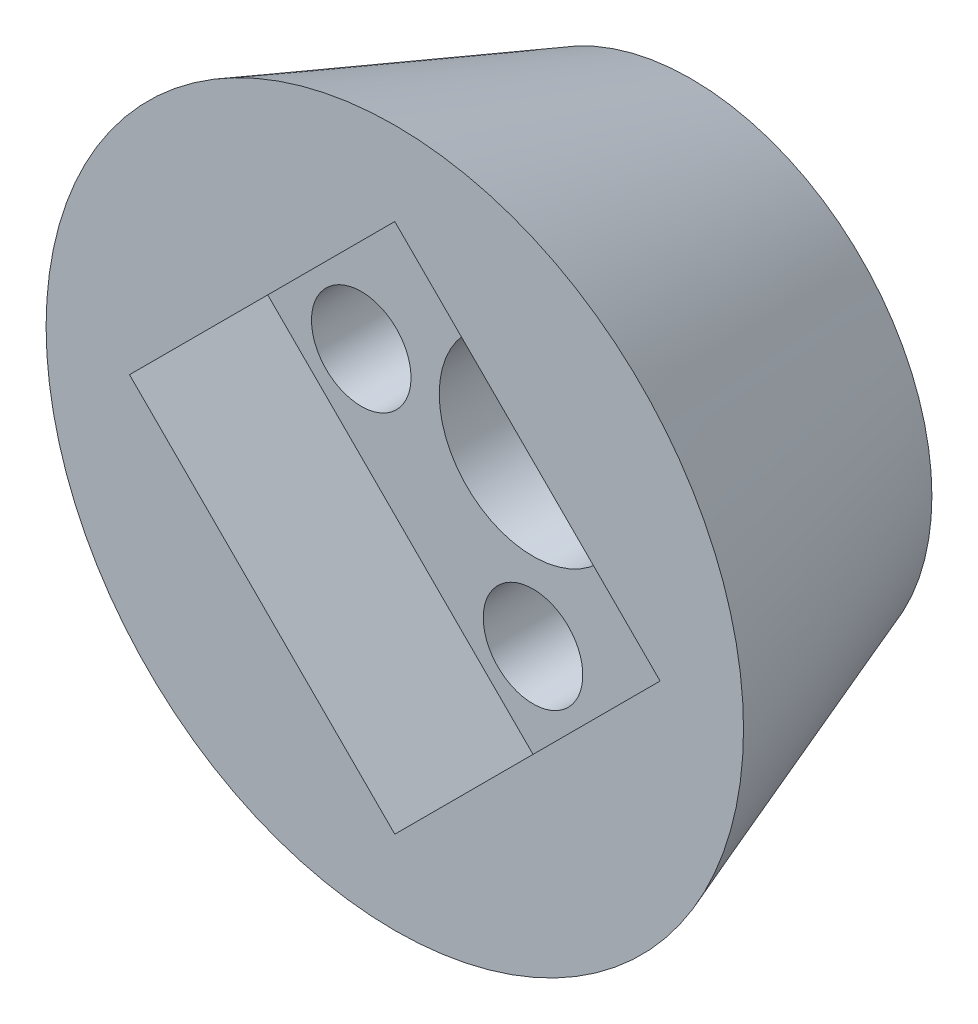
ISO-10303-21;
HEADER;
FILE_DESCRIPTION(('STEP AP214'),'2;1');
FILE_NAME('part.step','',(''),(''),'','','');
FILE_SCHEMA(('AUTOMOTIVE_DESIGN { 1 0 10303 214 1 1 1 1 }'));
ENDSEC;
DATA;
#1=APPLICATION_CONTEXT('core data for automotive mechanical design processes');
#2=APPLICATION_PROTOCOL_DEFINITION('international standard','automotive_design',2000,#1);
#3=PRODUCT_CONTEXT('',#1,'mechanical');
#4=PRODUCT('Part','Part','',(#3));
#5=PRODUCT_RELATED_PRODUCT_CATEGORY('part','',(#4));
#6=PRODUCT_DEFINITION_FORMATION('','',#4);
#7=PRODUCT_DEFINITION_CONTEXT('part definition',#1,'design');
#8=PRODUCT_DEFINITION('design','',#6,#7);
#9=PRODUCT_DEFINITION_SHAPE('','',#8);
#10=(LENGTH_UNIT() NAMED_UNIT(*) SI_UNIT(.MILLI.,.METRE.));
#11=(NAMED_UNIT(*) PLANE_ANGLE_UNIT() SI_UNIT($,.RADIAN.));
#12=(NAMED_UNIT(*) SI_UNIT($,.STERADIAN.) SOLID_ANGLE_UNIT());
#13=UNCERTAINTY_MEASURE_WITH_UNIT(LENGTH_MEASURE(1.E-05),#10,'distance_accuracy_value','');
#14=(GEOMETRIC_REPRESENTATION_CONTEXT(3) GLOBAL_UNCERTAINTY_ASSIGNED_CONTEXT((#13)) GLOBAL_UNIT_ASSIGNED_CONTEXT((#10,
#11,#12)) REPRESENTATION_CONTEXT('',''));
#15=CARTESIAN_POINT('',(0.,0.,0.));
#16=DIRECTION('',(0.,0.,1.));
#17=DIRECTION('',(1.,0.,0.));
#18=AXIS2_PLACEMENT_3D('',#15,#16,#17);
#19=CARTESIAN_POINT('',(0.,0.,0.));
#20=DIRECTION('',(0.,0.,1.));
#21=DIRECTION('',(1.,0.,0.));
#22=AXIS2_PLACEMENT_3D('',#19,#20,#21);
#23=CONICAL_SURFACE('',#22,12.2,0.349065850398867);
#24=CARTESIAN_POINT('',(0.,0.,15.));
#25=DIRECTION('',(0.,0.,1.));
#26=DIRECTION('',(1.,0.,0.));
#27=AXIS2_PLACEMENT_3D('',#24,#25,#26);
#28=CIRCLE('',#27,17.659553513993);
#29=CARTESIAN_POINT('',(17.659553513993,0.,15.));
#30=VERTEX_POINT('',#29);
#31=EDGE_CURVE('E11',#30,#30,#28,.T.);
#32=ORIENTED_EDGE('',*,*,#31,.F.);
#33=EDGE_LOOP('',(#32));
#34=FACE_BOUND('',#33,.T.);
#35=CARTESIAN_POINT('',(0.,0.,0.));
#36=DIRECTION('',(0.,0.,1.));
#37=DIRECTION('',(1.,0.,0.));
#38=AXIS2_PLACEMENT_3D('',#35,#36,#37);
#39=CIRCLE('',#38,12.2);
#40=CARTESIAN_POINT('',(12.2,0.,0.));
#41=VERTEX_POINT('',#40);
#42=EDGE_CURVE('E40',#41,#41,#39,.T.);
#43=ORIENTED_EDGE('',*,*,#42,.T.);
#44=EDGE_LOOP('',(#43));
#45=FACE_BOUND('',#44,.T.);
#46=ADVANCED_FACE('F32',(#34,#45),#23,.T.);
#47=CARTESIAN_POINT('',(0.,0.,15.));
#48=DIRECTION('',(0.,0.,1.));
#49=DIRECTION('',(1.,0.,0.));
#50=AXIS2_PLACEMENT_3D('',#47,#48,#49);
#51=PLANE('',#50);
#52=DIRECTION('',(-0.707106781186547,-0.707106781186548,0.));
#53=VECTOR('',#52,1.);
#54=CARTESIAN_POINT('',(-13.4350288425444,0.,15.));
#55=LINE('',#54,#53);
#56=CARTESIAN_POINT('',(0.,13.4350288425444,15.));
#57=VERTEX_POINT('',#56);
#58=CARTESIAN_POINT('',(-13.4350288425444,0.,15.));
#59=VERTEX_POINT('',#58);
#60=EDGE_CURVE('E47',#57,#59,#55,.T.);
#61=ORIENTED_EDGE('',*,*,#60,.F.);
#62=DIRECTION('',(-0.707106781186548,0.707106781186548,0.));
#63=VECTOR('',#62,1.);
#64=CARTESIAN_POINT('',(0.,13.4350288425444,15.));
#65=LINE('',#64,#63);
#66=CARTESIAN_POINT('',(13.4350288425444,0.,15.));
#67=VERTEX_POINT('',#66);
#68=EDGE_CURVE('E99',#67,#57,#65,.T.);
#69=ORIENTED_EDGE('',*,*,#68,.F.);
#70=DIRECTION('',(0.707106781186548,0.707106781186548,0.));
#71=VECTOR('',#70,1.);
#72=CARTESIAN_POINT('',(13.4350288425444,0.,15.));
#73=LINE('',#72,#71);
#74=CARTESIAN_POINT('',(0.,-13.4350288425444,15.));
#75=VERTEX_POINT('',#74);
#76=EDGE_CURVE('E105',#75,#67,#73,.T.);
#77=ORIENTED_EDGE('',*,*,#76,.F.);
#78=DIRECTION('',(0.707106781186548,-0.707106781186548,0.));
#79=VECTOR('',#78,1.);
#80=CARTESIAN_POINT('',(0.,-13.4350288425444,15.));
#81=LINE('',#80,#79);
#82=EDGE_CURVE('E82',#59,#75,#81,.T.);
#83=ORIENTED_EDGE('',*,*,#82,.F.);
#84=EDGE_LOOP('',(#61,#69,#77,#83));
#85=FACE_BOUND('',#84,.T.);
#86=ORIENTED_EDGE('',*,*,#31,.T.);
#87=EDGE_LOOP('',(#86));
#88=FACE_BOUND('',#87,.T.);
#89=ADVANCED_FACE('F145',(#85,#88),#51,.T.);
#90=CARTESIAN_POINT('',(0.,0.,0.));
#91=DIRECTION('',(0.,0.,1.));
#92=DIRECTION('',(1.,0.,0.));
#93=AXIS2_PLACEMENT_3D('',#90,#91,#92);
#94=PLANE('',#93);
#95=CARTESIAN_POINT('',(8.7,0.,0.));
#96=DIRECTION('',(0.,0.,-1.));
#97=DIRECTION('',(-1.,0.,0.));
#98=AXIS2_PLACEMENT_3D('',#95,#96,#97);
#99=CIRCLE('',#98,2.52);
#100=CARTESIAN_POINT('',(6.18,0.,0.));
#101=VERTEX_POINT('',#100);
#102=EDGE_CURVE('E123',#101,#101,#99,.T.);
#103=ORIENTED_EDGE('',*,*,#102,.F.);
#104=EDGE_LOOP('',(#103));
#105=FACE_BOUND('',#104,.T.);
#106=CARTESIAN_POINT('',(0.,-8.7,0.));
#107=DIRECTION('',(0.,0.,-1.));
#108=DIRECTION('',(-1.,0.,0.));
#109=AXIS2_PLACEMENT_3D('',#106,#107,#108);
#110=CIRCLE('',#109,2.52);
#111=CARTESIAN_POINT('',(-2.52,-8.7,0.));
#112=VERTEX_POINT('',#111);
#113=EDGE_CURVE('E126',#112,#112,#110,.T.);
#114=ORIENTED_EDGE('',*,*,#113,.F.);
#115=EDGE_LOOP('',(#114));
#116=FACE_BOUND('',#115,.T.);
#117=CARTESIAN_POINT('',(-8.7,0.,0.));
#118=DIRECTION('',(0.,0.,-1.));
#119=DIRECTION('',(-1.,0.,0.));
#120=AXIS2_PLACEMENT_3D('',#117,#118,#119);
#121=CIRCLE('',#120,2.52);
#122=CARTESIAN_POINT('',(-11.22,0.,0.));
#123=VERTEX_POINT('',#122);
#124=EDGE_CURVE('E129',#123,#123,#121,.T.);
#125=ORIENTED_EDGE('',*,*,#124,.F.);
#126=EDGE_LOOP('',(#125));
#127=FACE_BOUND('',#126,.T.);
#128=CARTESIAN_POINT('',(0.,8.7,0.));
#129=DIRECTION('',(0.,0.,-1.));
#130=DIRECTION('',(-1.,0.,0.));
#131=AXIS2_PLACEMENT_3D('',#128,#129,#130);
#132=CIRCLE('',#131,2.52);
#133=CARTESIAN_POINT('',(-2.52,8.7,0.));
#134=VERTEX_POINT('',#133);
#135=EDGE_CURVE('E132',#134,#134,#132,.T.);
#136=ORIENTED_EDGE('',*,*,#135,.F.);
#137=EDGE_LOOP('',(#136));
#138=FACE_BOUND('',#137,.T.);
#139=CARTESIAN_POINT('',(0.,0.,0.));
#140=DIRECTION('',(0.,0.,-1.));
#141=DIRECTION('',(-1.,0.,0.));
#142=AXIS2_PLACEMENT_3D('',#139,#140,#141);
#143=CIRCLE('',#142,4.75);
#144=CARTESIAN_POINT('',(-4.75,0.,0.));
#145=VERTEX_POINT('',#144);
#146=EDGE_CURVE('E135',#145,#145,#143,.T.);
#147=ORIENTED_EDGE('',*,*,#146,.F.);
#148=EDGE_LOOP('',(#147));
#149=FACE_BOUND('',#148,.T.);
#150=ORIENTED_EDGE('',*,*,#42,.F.);
#151=EDGE_LOOP('',(#150));
#152=FACE_BOUND('',#151,.T.);
#153=ADVANCED_FACE('F142',(#105,#116,#127,#138,#149,#152),#94,.F.);
#154=CARTESIAN_POINT('',(0.,0.,15.));
#155=DIRECTION('',(0.,0.,-1.));
#156=DIRECTION('',(-1.,0.,0.));
#157=AXIS2_PLACEMENT_3D('',#154,#155,#156);
#158=CYLINDRICAL_SURFACE('',#157,4.75);
#159=CARTESIAN_POINT('',(0.,0.,8.));
#160=DIRECTION('',(0.,0.,-1.));
#161=DIRECTION('',(-1.,0.,0.));
#162=AXIS2_PLACEMENT_3D('',#159,#160,#161);
#163=CIRCLE('',#162,4.75);
#164=CARTESIAN_POINT('',(-4.75,0.,8.));
#165=VERTEX_POINT('',#164);
#166=EDGE_CURVE('E120',#165,#165,#163,.F.);
#167=ORIENTED_EDGE('',*,*,#166,.T.);
#168=EDGE_LOOP('',(#167));
#169=FACE_BOUND('',#168,.T.);
#170=ORIENTED_EDGE('',*,*,#146,.T.);
#171=EDGE_LOOP('',(#170));
#172=FACE_BOUND('',#171,.T.);
#173=ADVANCED_FACE('F144',(#169,#172),#158,.F.);
#174=CARTESIAN_POINT('',(0.,8.7,15.));
#175=DIRECTION('',(0.,0.,-1.));
#176=DIRECTION('',(-1.,0.,0.));
#177=AXIS2_PLACEMENT_3D('',#174,#175,#176);
#178=CYLINDRICAL_SURFACE('',#177,2.52);
#179=CARTESIAN_POINT('',(0.,8.7,8.));
#180=DIRECTION('',(0.,0.,-1.));
#181=DIRECTION('',(-1.,0.,0.));
#182=AXIS2_PLACEMENT_3D('',#179,#180,#181);
#183=CIRCLE('',#182,2.52);
#184=CARTESIAN_POINT('',(-2.52,8.7,8.));
#185=VERTEX_POINT('',#184);
#186=EDGE_CURVE('E117',#185,#185,#183,.F.);
#187=ORIENTED_EDGE('',*,*,#186,.T.);
#188=EDGE_LOOP('',(#187));
#189=FACE_BOUND('',#188,.T.);
#190=ORIENTED_EDGE('',*,*,#135,.T.);
#191=EDGE_LOOP('',(#190));
#192=FACE_BOUND('',#191,.T.);
#193=ADVANCED_FACE('F151',(#189,#192),#178,.F.);
#194=CARTESIAN_POINT('',(-8.7,0.,15.));
#195=DIRECTION('',(0.,0.,-1.));
#196=DIRECTION('',(-1.,0.,0.));
#197=AXIS2_PLACEMENT_3D('',#194,#195,#196);
#198=CYLINDRICAL_SURFACE('',#197,2.52);
#199=CARTESIAN_POINT('',(-8.7,0.,8.));
#200=DIRECTION('',(0.,0.,-1.));
#201=DIRECTION('',(-1.,0.,0.));
#202=AXIS2_PLACEMENT_3D('',#199,#200,#201);
#203=CIRCLE('',#202,2.52);
#204=CARTESIAN_POINT('',(-11.22,0.,8.));
#205=VERTEX_POINT('',#204);
#206=EDGE_CURVE('E114',#205,#205,#203,.F.);
#207=ORIENTED_EDGE('',*,*,#206,.T.);
#208=EDGE_LOOP('',(#207));
#209=FACE_BOUND('',#208,.T.);
#210=ORIENTED_EDGE('',*,*,#124,.T.);
#211=EDGE_LOOP('',(#210));
#212=FACE_BOUND('',#211,.T.);
#213=ADVANCED_FACE('F185',(#209,#212),#198,.F.);
#214=CARTESIAN_POINT('',(0.,-8.7,15.));
#215=DIRECTION('',(0.,0.,-1.));
#216=DIRECTION('',(-1.,0.,0.));
#217=AXIS2_PLACEMENT_3D('',#214,#215,#216);
#218=CYLINDRICAL_SURFACE('',#217,2.52);
#219=CARTESIAN_POINT('',(0.,-8.7,8.));
#220=DIRECTION('',(0.,0.,-1.));
#221=DIRECTION('',(-1.,0.,0.));
#222=AXIS2_PLACEMENT_3D('',#219,#220,#221);
#223=CIRCLE('',#222,2.52);
#224=CARTESIAN_POINT('',(-2.52,-8.7,8.));
#225=VERTEX_POINT('',#224);
#226=EDGE_CURVE('E111',#225,#225,#223,.F.);
#227=ORIENTED_EDGE('',*,*,#226,.T.);
#228=EDGE_LOOP('',(#227));
#229=FACE_BOUND('',#228,.T.);
#230=ORIENTED_EDGE('',*,*,#113,.T.);
#231=EDGE_LOOP('',(#230));
#232=FACE_BOUND('',#231,.T.);
#233=ADVANCED_FACE('F195',(#229,#232),#218,.F.);
#234=CARTESIAN_POINT('',(8.7,0.,15.));
#235=DIRECTION('',(0.,0.,-1.));
#236=DIRECTION('',(-1.,0.,0.));
#237=AXIS2_PLACEMENT_3D('',#234,#235,#236);
#238=CYLINDRICAL_SURFACE('',#237,2.52);
#239=CARTESIAN_POINT('',(8.7,0.,8.));
#240=DIRECTION('',(0.,0.,-1.));
#241=DIRECTION('',(-1.,0.,0.));
#242=AXIS2_PLACEMENT_3D('',#239,#240,#241);
#243=CIRCLE('',#242,2.52);
#244=CARTESIAN_POINT('',(6.18,0.,8.));
#245=VERTEX_POINT('',#244);
#246=EDGE_CURVE('E35',#245,#245,#243,.F.);
#247=ORIENTED_EDGE('',*,*,#246,.T.);
#248=EDGE_LOOP('',(#247));
#249=FACE_BOUND('',#248,.T.);
#250=ORIENTED_EDGE('',*,*,#102,.T.);
#251=EDGE_LOOP('',(#250));
#252=FACE_BOUND('',#251,.T.);
#253=ADVANCED_FACE('F205',(#249,#252),#238,.F.);
#254=CARTESIAN_POINT('',(0.,0.,8.));
#255=DIRECTION('',(0.,0.,-1.));
#256=DIRECTION('',(-1.,0.,0.));
#257=AXIS2_PLACEMENT_3D('',#254,#255,#256);
#258=PLANE('',#257);
#259=ORIENTED_EDGE('',*,*,#186,.F.);
#260=EDGE_LOOP('',(#259));
#261=FACE_BOUND('',#260,.T.);
#262=ORIENTED_EDGE('',*,*,#226,.F.);
#263=EDGE_LOOP('',(#262));
#264=FACE_BOUND('',#263,.T.);
#265=DIRECTION('',(-0.707106781186547,-0.707106781186548,0.));
#266=VECTOR('',#265,1.);
#267=CARTESIAN_POINT('',(-13.4350288425444,0.,8.));
#268=LINE('',#267,#266);
#269=CARTESIAN_POINT('',(0.,13.4350288425444,8.));
#270=VERTEX_POINT('',#269);
#271=CARTESIAN_POINT('',(-13.4350288425444,0.,8.));
#272=VERTEX_POINT('',#271);
#273=EDGE_CURVE('E97',#270,#272,#268,.T.);
#274=ORIENTED_EDGE('',*,*,#273,.T.);
#275=DIRECTION('',(0.707106781186548,-0.707106781186548,0.));
#276=VECTOR('',#275,1.);
#277=CARTESIAN_POINT('',(0.,-13.4350288425444,8.));
#278=LINE('',#277,#276);
#279=CARTESIAN_POINT('',(0.,-13.4350288425444,8.));
#280=VERTEX_POINT('',#279);
#281=EDGE_CURVE('E79',#272,#280,#278,.T.);
#282=ORIENTED_EDGE('',*,*,#281,.T.);
#283=DIRECTION('',(0.707106781186548,0.707106781186548,0.));
#284=VECTOR('',#283,1.);
#285=CARTESIAN_POINT('',(13.4350288425444,0.,8.));
#286=LINE('',#285,#284);
#287=CARTESIAN_POINT('',(13.4350288425444,0.,8.));
#288=VERTEX_POINT('',#287);
#289=EDGE_CURVE('E89',#280,#288,#286,.T.);
#290=ORIENTED_EDGE('',*,*,#289,.T.);
#291=DIRECTION('',(-0.707106781186548,0.707106781186548,0.));
#292=VECTOR('',#291,1.);
#293=CARTESIAN_POINT('',(0.,13.4350288425444,8.));
#294=LINE('',#293,#292);
#295=EDGE_CURVE('E93',#288,#270,#294,.T.);
#296=ORIENTED_EDGE('',*,*,#295,.T.);
#297=EDGE_LOOP('',(#274,#282,#290,#296));
#298=FACE_BOUND('',#297,.T.);
#299=ORIENTED_EDGE('',*,*,#246,.F.);
#300=EDGE_LOOP('',(#299));
#301=FACE_BOUND('',#300,.T.);
#302=ORIENTED_EDGE('',*,*,#206,.F.);
#303=EDGE_LOOP('',(#302));
#304=FACE_BOUND('',#303,.T.);
#305=ORIENTED_EDGE('',*,*,#166,.F.);
#306=EDGE_LOOP('',(#305));
#307=FACE_BOUND('',#306,.T.);
#308=ADVANCED_FACE('F95',(#261,#264,#298,#301,#304,#307),#258,.F.);
#309=CARTESIAN_POINT('',(-13.4350288425444,0.,8.));
#310=DIRECTION('',(-0.707106781186548,0.707106781186548,0.));
#311=DIRECTION('',(-0.707106781186547,-0.707106781186548,0.));
#312=AXIS2_PLACEMENT_3D('',#309,#310,#311);
#313=PLANE('',#312);
#314=ORIENTED_EDGE('',*,*,#60,.T.);
#315=DIRECTION('',(0.,0.,1.));
#316=VECTOR('',#315,1.);
#317=CARTESIAN_POINT('',(-13.4350288425444,0.,8.));
#318=LINE('',#317,#316);
#319=EDGE_CURVE('E70',#272,#59,#318,.T.);
#320=ORIENTED_EDGE('',*,*,#319,.F.);
#321=ORIENTED_EDGE('',*,*,#273,.F.);
#322=DIRECTION('',(0.,0.,1.));
#323=VECTOR('',#322,1.);
#324=CARTESIAN_POINT('',(0.,13.4350288425444,8.));
#325=LINE('',#324,#323);
#326=EDGE_CURVE('E55',#270,#57,#325,.T.);
#327=ORIENTED_EDGE('',*,*,#326,.T.);
#328=EDGE_LOOP('',(#314,#320,#321,#327));
#329=FACE_BOUND('',#328,.T.);
#330=ADVANCED_FACE('F224',(#329),#313,.F.);
#331=CARTESIAN_POINT('',(0.,13.4350288425444,8.));
#332=DIRECTION('',(0.707106781186547,0.707106781186547,0.));
#333=DIRECTION('',(-0.707106781186548,0.707106781186548,0.));
#334=AXIS2_PLACEMENT_3D('',#331,#332,#333);
#335=PLANE('',#334);
#336=ORIENTED_EDGE('',*,*,#68,.T.);
#337=ORIENTED_EDGE('',*,*,#326,.F.);
#338=ORIENTED_EDGE('',*,*,#295,.F.);
#339=DIRECTION('',(0.,0.,1.));
#340=VECTOR('',#339,1.);
#341=CARTESIAN_POINT('',(13.4350288425444,0.,8.));
#342=LINE('',#341,#340);
#343=EDGE_CURVE('E86',#288,#67,#342,.T.);
#344=ORIENTED_EDGE('',*,*,#343,.T.);
#345=EDGE_LOOP('',(#336,#337,#338,#344));
#346=FACE_BOUND('',#345,.T.);
#347=ADVANCED_FACE('F234',(#346),#335,.F.);
#348=CARTESIAN_POINT('',(13.4350288425444,0.,8.));
#349=DIRECTION('',(0.707106781186547,-0.707106781186547,0.));
#350=DIRECTION('',(0.707106781186548,0.707106781186548,0.));
#351=AXIS2_PLACEMENT_3D('',#348,#349,#350);
#352=PLANE('',#351);
#353=ORIENTED_EDGE('',*,*,#76,.T.);
#354=ORIENTED_EDGE('',*,*,#343,.F.);
#355=ORIENTED_EDGE('',*,*,#289,.F.);
#356=DIRECTION('',(0.,0.,1.));
#357=VECTOR('',#356,1.);
#358=CARTESIAN_POINT('',(0.,-13.4350288425444,8.));
#359=LINE('',#358,#357);
#360=EDGE_CURVE('E75',#280,#75,#359,.T.);
#361=ORIENTED_EDGE('',*,*,#360,.T.);
#362=EDGE_LOOP('',(#353,#354,#355,#361));
#363=FACE_BOUND('',#362,.T.);
#364=ADVANCED_FACE('F90',(#363),#352,.F.);
#365=CARTESIAN_POINT('',(0.,-13.4350288425444,8.));
#366=DIRECTION('',(-0.707106781186547,-0.707106781186547,0.));
#367=DIRECTION('',(0.707106781186548,-0.707106781186548,0.));
#368=AXIS2_PLACEMENT_3D('',#365,#366,#367);
#369=PLANE('',#368);
#370=ORIENTED_EDGE('',*,*,#82,.T.);
#371=ORIENTED_EDGE('',*,*,#360,.F.);
#372=ORIENTED_EDGE('',*,*,#281,.F.);
#373=ORIENTED_EDGE('',*,*,#319,.T.);
#374=EDGE_LOOP('',(#370,#371,#372,#373));
#375=FACE_BOUND('',#374,.T.);
#376=ADVANCED_FACE('F77',(#375),#369,.F.);
#377=CLOSED_SHELL('',(#46,#89,#153,#173,#193,#213,#233,#253,#308,#330,#347,#364,#376));
#378=MANIFOLD_SOLID_BREP('B2',#377);
#379=ADVANCED_BREP_SHAPE_REPRESENTATION('',(#18,#378),#14);
#380=SHAPE_DEFINITION_REPRESENTATION(#9,#379);
ENDSEC;
END-ISO-10303-21;
